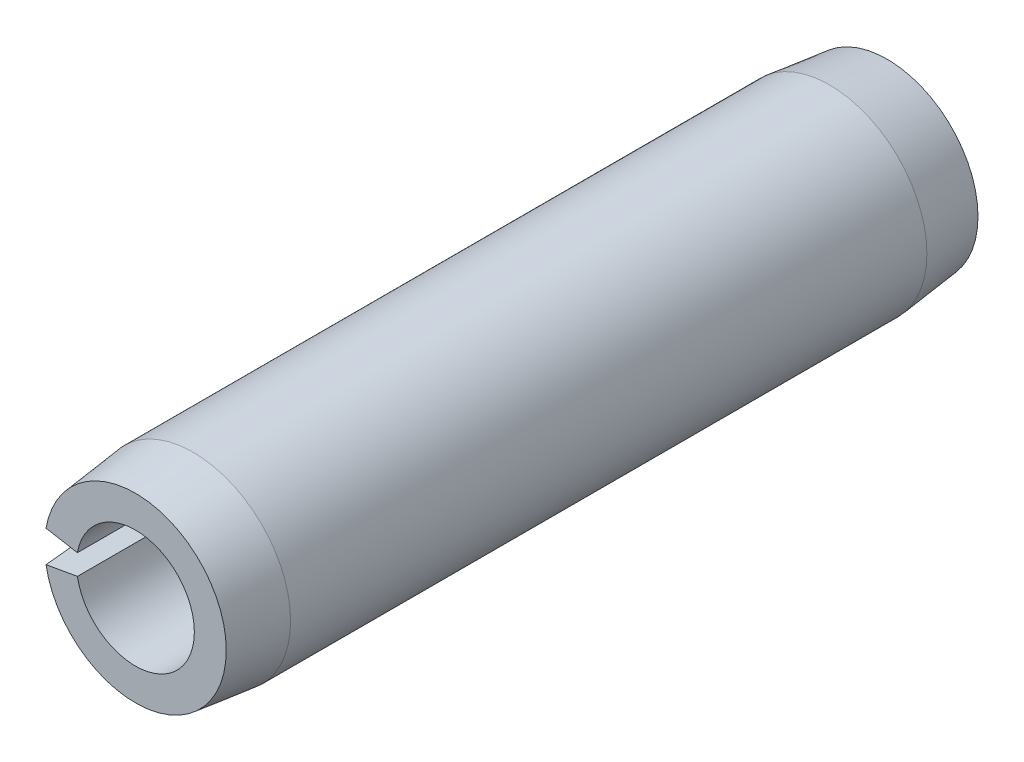
ISO-10303-21;
HEADER;
FILE_DESCRIPTION(('STEP AP214'),'2;1');
FILE_NAME('part.step','',(''),(''),'','','');
FILE_SCHEMA(('AUTOMOTIVE_DESIGN { 1 0 10303 214 1 1 1 1 }'));
ENDSEC;
DATA;
#1=APPLICATION_CONTEXT('core data for automotive mechanical design processes');
#2=APPLICATION_PROTOCOL_DEFINITION('international standard','automotive_design',2000,#1);
#3=PRODUCT_CONTEXT('',#1,'mechanical');
#4=PRODUCT('Part','Part','',(#3));
#5=PRODUCT_RELATED_PRODUCT_CATEGORY('part','',(#4));
#6=PRODUCT_DEFINITION_FORMATION('','',#4);
#7=PRODUCT_DEFINITION_CONTEXT('part definition',#1,'design');
#8=PRODUCT_DEFINITION('design','',#6,#7);
#9=PRODUCT_DEFINITION_SHAPE('','',#8);
#10=(LENGTH_UNIT() NAMED_UNIT(*) SI_UNIT(.MILLI.,.METRE.));
#11=(NAMED_UNIT(*) PLANE_ANGLE_UNIT() SI_UNIT($,.RADIAN.));
#12=(NAMED_UNIT(*) SI_UNIT($,.STERADIAN.) SOLID_ANGLE_UNIT());
#13=UNCERTAINTY_MEASURE_WITH_UNIT(LENGTH_MEASURE(1.E-05),#10,'distance_accuracy_value','');
#14=(GEOMETRIC_REPRESENTATION_CONTEXT(3) GLOBAL_UNCERTAINTY_ASSIGNED_CONTEXT((#13)) GLOBAL_UNIT_ASSIGNED_CONTEXT((#10,
#11,#12)) REPRESENTATION_CONTEXT('',''));
#15=CARTESIAN_POINT('',(0.,0.,0.));
#16=DIRECTION('',(0.,0.,1.));
#17=DIRECTION('',(1.,0.,0.));
#18=AXIS2_PLACEMENT_3D('',#15,#16,#17);
#19=CARTESIAN_POINT('',(0.,0.,7.9375));
#20=DIRECTION('',(0.,0.,-1.));
#21=DIRECTION('',(-1.,0.,0.));
#22=AXIS2_PLACEMENT_3D('',#19,#20,#21);
#23=CYLINDRICAL_SURFACE('',#22,1.2446);
#24=CARTESIAN_POINT('',(0.,0.,-7.9375));
#25=DIRECTION('',(0.,0.,-1.));
#26=DIRECTION('',(1.,0.,0.));
#27=AXIS2_PLACEMENT_3D('',#24,#25,#26);
#28=CIRCLE('',#27,1.2446);
#29=CARTESIAN_POINT('',(-1.22569172939899,0.216122521924258,-7.9375));
#30=VERTEX_POINT('',#29);
#31=CARTESIAN_POINT('',(-1.22569172939899,-0.216122521924258,-7.9375));
#32=VERTEX_POINT('',#31);
#33=EDGE_CURVE('E115',#30,#32,#28,.T.);
#34=ORIENTED_EDGE('',*,*,#33,.T.);
#35=DIRECTION('',(0.,0.,-1.));
#36=VECTOR('',#35,1.);
#37=CARTESIAN_POINT('',(-1.22569172939899,-0.216122521924258,7.9375));
#38=LINE('',#37,#36);
#39=CARTESIAN_POINT('',(-1.22569172939899,-0.216122521924258,7.9375));
#40=VERTEX_POINT('',#39);
#41=EDGE_CURVE('E11',#40,#32,#38,.T.);
#42=ORIENTED_EDGE('',*,*,#41,.F.);
#43=CARTESIAN_POINT('',(0.,0.,7.9375));
#44=DIRECTION('',(0.,0.,-1.));
#45=DIRECTION('',(1.,0.,0.));
#46=AXIS2_PLACEMENT_3D('',#43,#44,#45);
#47=CIRCLE('',#46,1.2446);
#48=CARTESIAN_POINT('',(-1.22569172939899,0.216122521924258,7.9375));
#49=VERTEX_POINT('',#48);
#50=EDGE_CURVE('E111',#49,#40,#47,.T.);
#51=ORIENTED_EDGE('',*,*,#50,.F.);
#52=DIRECTION('',(0.,0.,-1.));
#53=VECTOR('',#52,1.);
#54=CARTESIAN_POINT('',(-1.22569172939899,0.216122521924258,7.9375));
#55=LINE('',#54,#53);
#56=EDGE_CURVE('E104',#49,#30,#55,.T.);
#57=ORIENTED_EDGE('',*,*,#56,.T.);
#58=EDGE_LOOP('',(#34,#42,#51,#57));
#59=FACE_BOUND('',#58,.T.);
#60=ADVANCED_FACE('F32',(#59),#23,.F.);
#61=CARTESIAN_POINT('',(-1.22569172939899,-0.216122521924258,7.9375));
#62=DIRECTION('',(0.173648177666927,-0.984807753012209,0.));
#63=DIRECTION('',(0.984807753012209,0.173648177666927,0.));
#64=AXIS2_PLACEMENT_3D('',#61,#62,#63);
#65=PLANE('',#64);
#66=DIRECTION('',(0.,0.,-1.));
#67=VECTOR('',#66,1.);
#68=CARTESIAN_POINT('',(-2.02614347104732,-0.357263760731936,7.9375));
#69=LINE('',#68,#67);
#70=CARTESIAN_POINT('',(-2.02614347104732,-0.357263760731936,6.7183));
#71=VERTEX_POINT('',#70);
#72=CARTESIAN_POINT('',(-2.02614347104732,-0.357263760731936,-6.7183));
#73=VERTEX_POINT('',#72);
#74=EDGE_CURVE('E39',#71,#73,#69,.T.);
#75=ORIENTED_EDGE('',*,*,#74,.F.);
#76=DIRECTION('',(-0.112108996385355,-0.0197678408428855,-0.993499272973));
#77=VECTOR('',#76,1.);
#78=CARTESIAN_POINT('',(0.,0.,24.6737909090906));
#79=LINE('',#78,#77);
#80=CARTESIAN_POINT('',(-1.88856582795151,-0.333005110311867,7.9375));
#81=VERTEX_POINT('',#80);
#82=EDGE_CURVE('E86',#71,#81,#79,.F.);
#83=ORIENTED_EDGE('',*,*,#82,.T.);
#84=DIRECTION('',(-0.984807753012208,-0.173648177666927,0.));
#85=VECTOR('',#84,1.);
#86=CARTESIAN_POINT('',(-1.22569172939899,-0.216122521924258,7.9375));
#87=LINE('',#86,#85);
#88=EDGE_CURVE('E119',#40,#81,#87,.T.);
#89=ORIENTED_EDGE('',*,*,#88,.F.);
#90=ORIENTED_EDGE('',*,*,#41,.T.);
#91=DIRECTION('',(-0.984807753012208,-0.173648177666927,0.));
#92=VECTOR('',#91,1.);
#93=CARTESIAN_POINT('',(-1.22569172939899,-0.216122521924258,-7.9375));
#94=LINE('',#93,#92);
#95=CARTESIAN_POINT('',(-1.88856582795151,-0.333005110311867,-7.9375));
#96=VERTEX_POINT('',#95);
#97=EDGE_CURVE('E112',#32,#96,#94,.T.);
#98=ORIENTED_EDGE('',*,*,#97,.T.);
#99=DIRECTION('',(0.112108996385355,0.0197678408428855,-0.993499272973));
#100=VECTOR('',#99,1.);
#101=CARTESIAN_POINT('',(0.,0.,-24.6737909090906));
#102=LINE('',#101,#100);
#103=EDGE_CURVE('E54',#96,#73,#102,.F.);
#104=ORIENTED_EDGE('',*,*,#103,.T.);
#105=EDGE_LOOP('',(#75,#83,#89,#90,#98,#104));
#106=FACE_BOUND('',#105,.T.);
#107=ADVANCED_FACE('F133',(#106),#65,.F.);
#108=CARTESIAN_POINT('',(0.,0.,7.9375));
#109=DIRECTION('',(0.,0.,-1.));
#110=DIRECTION('',(-1.,0.,0.));
#111=AXIS2_PLACEMENT_3D('',#108,#109,#110);
#112=CYLINDRICAL_SURFACE('',#111,2.0574);
#113=DIRECTION('',(0.,0.,-1.));
#114=VECTOR('',#113,1.);
#115=CARTESIAN_POINT('',(-2.02614347104732,0.357263760731936,7.9375));
#116=LINE('',#115,#114);
#117=CARTESIAN_POINT('',(-2.02614347104732,0.357263760731937,6.7183));
#118=VERTEX_POINT('',#117);
#119=CARTESIAN_POINT('',(-2.02614347104732,0.357263760731937,-6.7183));
#120=VERTEX_POINT('',#119);
#121=EDGE_CURVE('E96',#118,#120,#116,.T.);
#122=ORIENTED_EDGE('',*,*,#121,.F.);
#123=CARTESIAN_POINT('',(0.,0.,6.7183));
#124=DIRECTION('',(0.,0.,-1.));
#125=DIRECTION('',(-1.,0.,0.));
#126=AXIS2_PLACEMENT_3D('',#123,#124,#125);
#127=CIRCLE('',#126,2.0574);
#128=EDGE_CURVE('E83',#118,#71,#127,.T.);
#129=ORIENTED_EDGE('',*,*,#128,.T.);
#130=ORIENTED_EDGE('',*,*,#74,.T.);
#131=CARTESIAN_POINT('',(0.,0.,-6.7183));
#132=DIRECTION('',(0.,0.,-1.));
#133=DIRECTION('',(-1.,0.,0.));
#134=AXIS2_PLACEMENT_3D('',#131,#132,#133);
#135=CIRCLE('',#134,2.0574);
#136=EDGE_CURVE('E103',#120,#73,#135,.T.);
#137=ORIENTED_EDGE('',*,*,#136,.F.);
#138=EDGE_LOOP('',(#122,#129,#130,#137));
#139=FACE_BOUND('',#138,.T.);
#140=ADVANCED_FACE('F102',(#139),#112,.T.);
#141=CARTESIAN_POINT('',(-2.02614347104732,0.357263760731936,7.9375));
#142=DIRECTION('',(0.173648177666927,0.984807753012209,0.));
#143=DIRECTION('',(-0.984807753012209,0.173648177666927,0.));
#144=AXIS2_PLACEMENT_3D('',#141,#142,#143);
#145=PLANE('',#144);
#146=DIRECTION('',(0.984807753012208,-0.173648177666927,0.));
#147=VECTOR('',#146,1.);
#148=CARTESIAN_POINT('',(-2.02614347104732,0.357263760731936,7.9375));
#149=LINE('',#148,#147);
#150=CARTESIAN_POINT('',(-1.88856582795151,0.333005110311867,7.9375));
#151=VERTEX_POINT('',#150);
#152=EDGE_CURVE('E99',#151,#49,#149,.T.);
#153=ORIENTED_EDGE('',*,*,#152,.F.);
#154=DIRECTION('',(0.112108996385355,-0.0197678408428855,0.993499272973));
#155=VECTOR('',#154,1.);
#156=CARTESIAN_POINT('',(0.,0.,24.6737909090906));
#157=LINE('',#156,#155);
#158=EDGE_CURVE('E46',#151,#118,#157,.F.);
#159=ORIENTED_EDGE('',*,*,#158,.T.);
#160=ORIENTED_EDGE('',*,*,#121,.T.);
#161=DIRECTION('',(-0.112108996385355,0.0197678408428855,0.993499272973));
#162=VECTOR('',#161,1.);
#163=CARTESIAN_POINT('',(0.,0.,-24.6737909090906));
#164=LINE('',#163,#162);
#165=CARTESIAN_POINT('',(-1.88856582795151,0.333005110311867,-7.9375));
#166=VERTEX_POINT('',#165);
#167=EDGE_CURVE('E125',#120,#166,#164,.F.);
#168=ORIENTED_EDGE('',*,*,#167,.T.);
#169=DIRECTION('',(0.984807753012208,-0.173648177666927,0.));
#170=VECTOR('',#169,1.);
#171=CARTESIAN_POINT('',(-2.02614347104732,0.357263760731936,-7.9375));
#172=LINE('',#171,#170);
#173=EDGE_CURVE('E109',#166,#30,#172,.T.);
#174=ORIENTED_EDGE('',*,*,#173,.T.);
#175=ORIENTED_EDGE('',*,*,#56,.F.);
#176=EDGE_LOOP('',(#153,#159,#160,#168,#174,#175));
#177=FACE_BOUND('',#176,.T.);
#178=ADVANCED_FACE('F94',(#177),#145,.F.);
#179=CARTESIAN_POINT('',(0.,0.,7.9375));
#180=DIRECTION('',(0.,0.,1.));
#181=DIRECTION('',(1.,0.,0.));
#182=AXIS2_PLACEMENT_3D('',#179,#180,#181);
#183=PLANE('',#182);
#184=CARTESIAN_POINT('',(0.,0.,7.9375));
#185=DIRECTION('',(0.,0.,-1.));
#186=DIRECTION('',(-1.,0.,0.));
#187=AXIS2_PLACEMENT_3D('',#184,#185,#186);
#188=CIRCLE('',#187,1.9177);
#189=EDGE_CURVE('E90',#151,#81,#188,.T.);
#190=ORIENTED_EDGE('',*,*,#189,.F.);
#191=ORIENTED_EDGE('',*,*,#152,.T.);
#192=ORIENTED_EDGE('',*,*,#50,.T.);
#193=ORIENTED_EDGE('',*,*,#88,.T.);
#194=EDGE_LOOP('',(#190,#191,#192,#193));
#195=FACE_BOUND('',#194,.T.);
#196=ADVANCED_FACE('F134',(#195),#183,.T.);
#197=CARTESIAN_POINT('',(0.,0.,-7.9375));
#198=DIRECTION('',(0.,0.,1.));
#199=DIRECTION('',(1.,0.,0.));
#200=AXIS2_PLACEMENT_3D('',#197,#198,#199);
#201=PLANE('',#200);
#202=ORIENTED_EDGE('',*,*,#173,.F.);
#203=CARTESIAN_POINT('',(0.,0.,-7.9375));
#204=DIRECTION('',(0.,0.,-1.));
#205=DIRECTION('',(-1.,0.,0.));
#206=AXIS2_PLACEMENT_3D('',#203,#204,#205);
#207=CIRCLE('',#206,1.9177);
#208=EDGE_CURVE('E127',#166,#96,#207,.T.);
#209=ORIENTED_EDGE('',*,*,#208,.T.);
#210=ORIENTED_EDGE('',*,*,#97,.F.);
#211=ORIENTED_EDGE('',*,*,#33,.F.);
#212=EDGE_LOOP('',(#202,#209,#210,#211));
#213=FACE_BOUND('',#212,.T.);
#214=ADVANCED_FACE('F141',(#213),#201,.F.);
#215=CARTESIAN_POINT('',(0.,0.,-6.7183));
#216=DIRECTION('',(0.,0.,1.));
#217=DIRECTION('',(1.,0.,0.));
#218=AXIS2_PLACEMENT_3D('',#215,#216,#217);
#219=CONICAL_SURFACE('',#218,2.0574,0.114085779168162);
#220=ORIENTED_EDGE('',*,*,#208,.F.);
#221=ORIENTED_EDGE('',*,*,#167,.F.);
#222=ORIENTED_EDGE('',*,*,#136,.T.);
#223=ORIENTED_EDGE('',*,*,#103,.F.);
#224=EDGE_LOOP('',(#220,#221,#222,#223));
#225=FACE_BOUND('',#224,.T.);
#226=ADVANCED_FACE('F142',(#225),#219,.T.);
#227=CARTESIAN_POINT('',(0.,0.,7.9375));
#228=DIRECTION('',(0.,0.,-1.));
#229=DIRECTION('',(-1.,0.,0.));
#230=AXIS2_PLACEMENT_3D('',#227,#228,#229);
#231=CONICAL_SURFACE('',#230,1.9177,0.114085779168162);
#232=ORIENTED_EDGE('',*,*,#128,.F.);
#233=ORIENTED_EDGE('',*,*,#158,.F.);
#234=ORIENTED_EDGE('',*,*,#189,.T.);
#235=ORIENTED_EDGE('',*,*,#82,.F.);
#236=EDGE_LOOP('',(#232,#233,#234,#235));
#237=FACE_BOUND('',#236,.T.);
#238=ADVANCED_FACE('F84',(#237),#231,.T.);
#239=CLOSED_SHELL('',(#60,#107,#140,#178,#196,#214,#226,#238));
#240=MANIFOLD_SOLID_BREP('B2',#239);
#241=ADVANCED_BREP_SHAPE_REPRESENTATION('',(#18,#240),#14);
#242=SHAPE_DEFINITION_REPRESENTATION(#9,#241);
ENDSEC;
END-ISO-10303-21;
